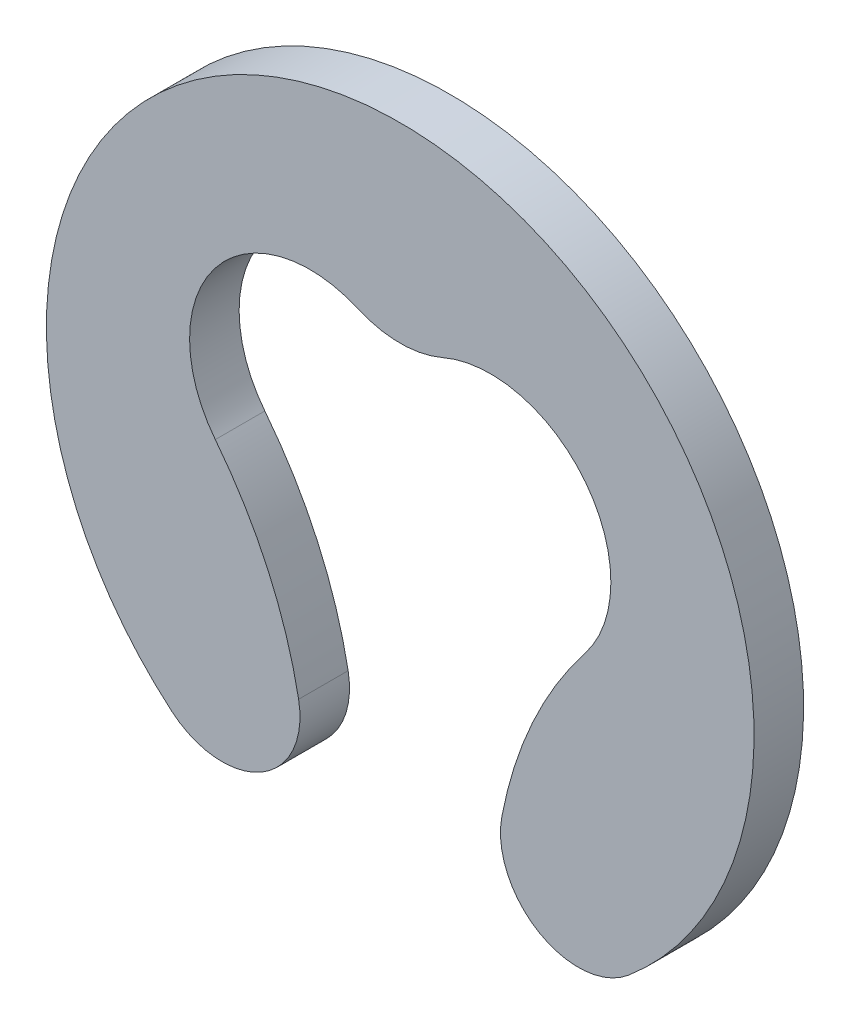
ISO-10303-21;
HEADER;
FILE_DESCRIPTION(('STEP AP214'),'2;1');
FILE_NAME('part.step','',(''),(''),'','','');
FILE_SCHEMA(('AUTOMOTIVE_DESIGN { 1 0 10303 214 1 1 1 1 }'));
ENDSEC;
DATA;
#1=APPLICATION_CONTEXT('core data for automotive mechanical design processes');
#2=APPLICATION_PROTOCOL_DEFINITION('international standard','automotive_design',2000,#1);
#3=PRODUCT_CONTEXT('',#1,'mechanical');
#4=PRODUCT('Part','Part','',(#3));
#5=PRODUCT_RELATED_PRODUCT_CATEGORY('part','',(#4));
#6=PRODUCT_DEFINITION_FORMATION('','',#4);
#7=PRODUCT_DEFINITION_CONTEXT('part definition',#1,'design');
#8=PRODUCT_DEFINITION('design','',#6,#7);
#9=PRODUCT_DEFINITION_SHAPE('','',#8);
#10=(LENGTH_UNIT() NAMED_UNIT(*) SI_UNIT(.MILLI.,.METRE.));
#11=(NAMED_UNIT(*) PLANE_ANGLE_UNIT() SI_UNIT($,.RADIAN.));
#12=(NAMED_UNIT(*) SI_UNIT($,.STERADIAN.) SOLID_ANGLE_UNIT());
#13=UNCERTAINTY_MEASURE_WITH_UNIT(LENGTH_MEASURE(1.E-05),#10,'distance_accuracy_value','');
#14=(GEOMETRIC_REPRESENTATION_CONTEXT(3) GLOBAL_UNCERTAINTY_ASSIGNED_CONTEXT((#13)) GLOBAL_UNIT_ASSIGNED_CONTEXT((#10,
#11,#12)) REPRESENTATION_CONTEXT('',''));
#15=CARTESIAN_POINT('',(0.,0.,0.));
#16=DIRECTION('',(0.,0.,1.));
#17=DIRECTION('',(1.,0.,0.));
#18=AXIS2_PLACEMENT_3D('',#15,#16,#17);
#19=CARTESIAN_POINT('',(0.,0.,0.7));
#20=DIRECTION('',(0.,0.,1.));
#21=DIRECTION('',(1.,0.,0.));
#22=AXIS2_PLACEMENT_3D('',#19,#20,#21);
#23=PLANE('',#22);
#24=CARTESIAN_POINT('',(7.33090114238568,-3.89202883347084,0.7));
#25=DIRECTION('',(0.,0.,-1.));
#26=DIRECTION('',(1.,0.,0.));
#27=AXIS2_PLACEMENT_3D('',#24,#25,#26);
#28=CIRCLE('',#27,6.);
#29=CARTESIAN_POINT('',(1.43590173451363,-2.77445020930684,0.7));
#30=VERTEX_POINT('',#29);
#31=CARTESIAN_POINT('',(2.61328937992658,-0.18471993634512,0.7));
#32=VERTEX_POINT('',#31);
#33=EDGE_CURVE('E149',#30,#32,#28,.T.);
#34=ORIENTED_EDGE('',*,*,#33,.F.);
#35=CARTESIAN_POINT('',(2.51665162595684,-2.97933962373691,0.7));
#36=DIRECTION('',(0.,0.,1.));
#37=DIRECTION('',(1.,0.,0.));
#38=AXIS2_PLACEMENT_3D('',#35,#36,#37);
#39=CIRCLE('',#38,1.1);
#40=CARTESIAN_POINT('',(3.22647644353441,-3.81966618427809,0.7));
#41=VERTEX_POINT('',#40);
#42=EDGE_CURVE('E179',#30,#41,#39,.T.);
#43=ORIENTED_EDGE('',*,*,#42,.T.);
#44=CARTESIAN_POINT('',(0.,0.,0.7));
#45=DIRECTION('',(0.,0.,1.));
#46=DIRECTION('',(1.,0.,0.));
#47=AXIS2_PLACEMENT_3D('',#44,#45,#46);
#48=CIRCLE('',#47,5.);
#49=CARTESIAN_POINT('',(-3.22647644353441,-3.81966618427809,0.7));
#50=VERTEX_POINT('',#49);
#51=EDGE_CURVE('E167',#41,#50,#48,.T.);
#52=ORIENTED_EDGE('',*,*,#51,.T.);
#53=CARTESIAN_POINT('',(-2.51665162595684,-2.97933962373691,0.7));
#54=DIRECTION('',(0.,0.,1.));
#55=DIRECTION('',(1.,0.,0.));
#56=AXIS2_PLACEMENT_3D('',#53,#54,#55);
#57=CIRCLE('',#56,1.1);
#58=CARTESIAN_POINT('',(-1.43590173451363,-2.77445020930684,0.7));
#59=VERTEX_POINT('',#58);
#60=EDGE_CURVE('E176',#50,#59,#57,.T.);
#61=ORIENTED_EDGE('',*,*,#60,.T.);
#62=CARTESIAN_POINT('',(-7.33090114238567,-3.89202883347085,0.7));
#63=DIRECTION('',(0.,0.,-1.));
#64=DIRECTION('',(-1.,0.,0.));
#65=AXIS2_PLACEMENT_3D('',#62,#63,#64);
#66=CIRCLE('',#65,6.);
#67=CARTESIAN_POINT('',(-2.61328937992658,-0.18471993634512,0.7));
#68=VERTEX_POINT('',#67);
#69=EDGE_CURVE('E146',#68,#59,#66,.T.);
#70=ORIENTED_EDGE('',*,*,#69,.F.);
#71=CARTESIAN_POINT('',(-1.2766327138965,0.865684251173833,0.7));
#72=DIRECTION('',(0.,0.,1.));
#73=DIRECTION('',(1.,0.,0.));
#74=AXIS2_PLACEMENT_3D('',#71,#72,#73);
#75=CIRCLE('',#74,1.7);
#76=CARTESIAN_POINT('',(-0.598421584638982,2.42453949273773,0.7));
#77=VERTEX_POINT('',#76);
#78=EDGE_CURVE('E120',#77,#68,#75,.T.);
#79=ORIENTED_EDGE('',*,*,#78,.F.);
#80=CARTESIAN_POINT('',(0.,3.8,0.7));
#81=DIRECTION('',(0.,0.,-1.));
#82=DIRECTION('',(1.,0.,0.));
#83=AXIS2_PLACEMENT_3D('',#80,#81,#82);
#84=CIRCLE('',#83,1.5);
#85=CARTESIAN_POINT('',(0.598421584638982,2.42453949273773,0.7));
#86=VERTEX_POINT('',#85);
#87=EDGE_CURVE('E124',#86,#77,#84,.T.);
#88=ORIENTED_EDGE('',*,*,#87,.F.);
#89=CARTESIAN_POINT('',(1.2766327138965,0.865684251173834,0.7));
#90=DIRECTION('',(0.,0.,1.));
#91=DIRECTION('',(-1.,0.,0.));
#92=AXIS2_PLACEMENT_3D('',#89,#90,#91);
#93=CIRCLE('',#92,1.7);
#94=EDGE_CURVE('E152',#32,#86,#93,.T.);
#95=ORIENTED_EDGE('',*,*,#94,.F.);
#96=EDGE_LOOP('',(#34,#43,#52,#61,#70,#79,#88,#95));
#97=FACE_BOUND('',#96,.T.);
#98=ADVANCED_FACE('F41',(#97),#23,.T.);
#99=CARTESIAN_POINT('',(0.,0.,0.));
#100=DIRECTION('',(0.,0.,1.));
#101=DIRECTION('',(1.,0.,0.));
#102=AXIS2_PLACEMENT_3D('',#99,#100,#101);
#103=PLANE('',#102);
#104=CARTESIAN_POINT('',(0.,0.,0.));
#105=DIRECTION('',(0.,0.,1.));
#106=DIRECTION('',(1.,0.,0.));
#107=AXIS2_PLACEMENT_3D('',#104,#105,#106);
#108=CIRCLE('',#107,5.);
#109=CARTESIAN_POINT('',(3.22647644353441,-3.81966618427809,0.));
#110=VERTEX_POINT('',#109);
#111=CARTESIAN_POINT('',(-3.22647644353441,-3.81966618427809,0.));
#112=VERTEX_POINT('',#111);
#113=EDGE_CURVE('E111',#110,#112,#108,.T.);
#114=ORIENTED_EDGE('',*,*,#113,.F.);
#115=CARTESIAN_POINT('',(2.51665162595684,-2.97933962373691,0.));
#116=DIRECTION('',(0.,0.,1.));
#117=DIRECTION('',(1.,0.,0.));
#118=AXIS2_PLACEMENT_3D('',#115,#116,#117);
#119=CIRCLE('',#118,1.1);
#120=CARTESIAN_POINT('',(1.43590173451363,-2.77445020930684,0.));
#121=VERTEX_POINT('',#120);
#122=EDGE_CURVE('E50',#110,#121,#119,.F.);
#123=ORIENTED_EDGE('',*,*,#122,.T.);
#124=CARTESIAN_POINT('',(7.33090114238568,-3.89202883347084,0.));
#125=DIRECTION('',(0.,0.,1.));
#126=DIRECTION('',(1.,0.,0.));
#127=AXIS2_PLACEMENT_3D('',#124,#125,#126);
#128=CIRCLE('',#127,6.);
#129=CARTESIAN_POINT('',(2.61328937992658,-0.18471993634512,0.));
#130=VERTEX_POINT('',#129);
#131=EDGE_CURVE('E140',#130,#121,#128,.T.);
#132=ORIENTED_EDGE('',*,*,#131,.F.);
#133=CARTESIAN_POINT('',(1.2766327138965,0.865684251173834,0.));
#134=DIRECTION('',(0.,0.,1.));
#135=DIRECTION('',(1.,0.,0.));
#136=AXIS2_PLACEMENT_3D('',#133,#134,#135);
#137=CIRCLE('',#136,1.7);
#138=CARTESIAN_POINT('',(0.598421584638982,2.42453949273773,0.));
#139=VERTEX_POINT('',#138);
#140=EDGE_CURVE('E134',#139,#130,#137,.F.);
#141=ORIENTED_EDGE('',*,*,#140,.F.);
#142=CARTESIAN_POINT('',(0.,3.8,0.));
#143=DIRECTION('',(0.,0.,1.));
#144=DIRECTION('',(1.,0.,0.));
#145=AXIS2_PLACEMENT_3D('',#142,#143,#144);
#146=CIRCLE('',#145,1.5);
#147=CARTESIAN_POINT('',(-0.598421584638982,2.42453949273773,0.));
#148=VERTEX_POINT('',#147);
#149=EDGE_CURVE('E129',#148,#139,#146,.T.);
#150=ORIENTED_EDGE('',*,*,#149,.F.);
#151=CARTESIAN_POINT('',(-1.2766327138965,0.865684251173833,0.));
#152=DIRECTION('',(0.,0.,1.));
#153=DIRECTION('',(1.,0.,0.));
#154=AXIS2_PLACEMENT_3D('',#151,#152,#153);
#155=CIRCLE('',#154,1.7);
#156=CARTESIAN_POINT('',(-2.61328937992658,-0.18471993634512,0.));
#157=VERTEX_POINT('',#156);
#158=EDGE_CURVE('E117',#157,#148,#155,.F.);
#159=ORIENTED_EDGE('',*,*,#158,.F.);
#160=CARTESIAN_POINT('',(-7.33090114238567,-3.89202883347085,0.));
#161=DIRECTION('',(0.,0.,1.));
#162=DIRECTION('',(1.,0.,0.));
#163=AXIS2_PLACEMENT_3D('',#160,#161,#162);
#164=CIRCLE('',#163,6.);
#165=CARTESIAN_POINT('',(-1.43590173451363,-2.77445020930684,0.));
#166=VERTEX_POINT('',#165);
#167=EDGE_CURVE('E104',#166,#157,#164,.T.);
#168=ORIENTED_EDGE('',*,*,#167,.F.);
#169=CARTESIAN_POINT('',(-2.51665162595684,-2.97933962373691,0.));
#170=DIRECTION('',(0.,0.,1.));
#171=DIRECTION('',(1.,0.,0.));
#172=AXIS2_PLACEMENT_3D('',#169,#170,#171);
#173=CIRCLE('',#172,1.1);
#174=EDGE_CURVE('E62',#166,#112,#173,.F.);
#175=ORIENTED_EDGE('',*,*,#174,.T.);
#176=EDGE_LOOP('',(#114,#123,#132,#141,#150,#159,#168,#175));
#177=FACE_BOUND('',#176,.T.);
#178=ADVANCED_FACE('F126',(#177),#103,.F.);
#179=CARTESIAN_POINT('',(0.,0.,0.7));
#180=DIRECTION('',(0.,0.,-1.));
#181=DIRECTION('',(-1.,0.,0.));
#182=AXIS2_PLACEMENT_3D('',#179,#180,#181);
#183=CYLINDRICAL_SURFACE('',#182,5.);
#184=ORIENTED_EDGE('',*,*,#51,.F.);
#185=DIRECTION('',(0.,0.,-1.));
#186=VECTOR('',#185,1.);
#187=CARTESIAN_POINT('',(3.22647644353441,-3.81966618427809,0.7));
#188=LINE('',#187,#186);
#189=EDGE_CURVE('E186',#41,#110,#188,.T.);
#190=ORIENTED_EDGE('',*,*,#189,.T.);
#191=ORIENTED_EDGE('',*,*,#113,.T.);
#192=DIRECTION('',(0.,0.,-1.));
#193=VECTOR('',#192,1.);
#194=CARTESIAN_POINT('',(-3.22647644353441,-3.81966618427809,0.7));
#195=LINE('',#194,#193);
#196=EDGE_CURVE('E182',#112,#50,#195,.F.);
#197=ORIENTED_EDGE('',*,*,#196,.T.);
#198=EDGE_LOOP('',(#184,#190,#191,#197));
#199=FACE_BOUND('',#198,.T.);
#200=ADVANCED_FACE('F204',(#199),#183,.T.);
#201=CARTESIAN_POINT('',(-1.2766327138965,0.865684251173833,-0.00100000000000002));
#202=DIRECTION('',(0.,0.,1.));
#203=DIRECTION('',(1.,0.,0.));
#204=AXIS2_PLACEMENT_3D('',#201,#202,#203);
#205=CYLINDRICAL_SURFACE('',#204,1.7);
#206=ORIENTED_EDGE('',*,*,#158,.T.);
#207=DIRECTION('',(0.,0.,1.));
#208=VECTOR('',#207,1.);
#209=CARTESIAN_POINT('',(-0.598421584638982,2.42453949273773,-0.00100000000000002));
#210=LINE('',#209,#208);
#211=EDGE_CURVE('E112',#148,#77,#210,.T.);
#212=ORIENTED_EDGE('',*,*,#211,.T.);
#213=ORIENTED_EDGE('',*,*,#78,.T.);
#214=DIRECTION('',(0.,0.,1.));
#215=VECTOR('',#214,1.);
#216=CARTESIAN_POINT('',(-2.61328937992658,-0.18471993634512,-0.00100000000000002));
#217=LINE('',#216,#215);
#218=EDGE_CURVE('E107',#157,#68,#217,.T.);
#219=ORIENTED_EDGE('',*,*,#218,.F.);
#220=EDGE_LOOP('',(#206,#212,#213,#219));
#221=FACE_BOUND('',#220,.T.);
#222=ADVANCED_FACE('F116',(#221),#205,.F.);
#223=CARTESIAN_POINT('',(0.,3.8,-0.00100000000000002));
#224=DIRECTION('',(0.,0.,1.));
#225=DIRECTION('',(1.,0.,0.));
#226=AXIS2_PLACEMENT_3D('',#223,#224,#225);
#227=CYLINDRICAL_SURFACE('',#226,1.5);
#228=ORIENTED_EDGE('',*,*,#149,.T.);
#229=DIRECTION('',(0.,0.,1.));
#230=VECTOR('',#229,1.);
#231=CARTESIAN_POINT('',(0.598421584638982,2.42453949273773,-0.00100000000000002));
#232=LINE('',#231,#230);
#233=EDGE_CURVE('E161',#139,#86,#232,.T.);
#234=ORIENTED_EDGE('',*,*,#233,.T.);
#235=ORIENTED_EDGE('',*,*,#87,.T.);
#236=ORIENTED_EDGE('',*,*,#211,.F.);
#237=EDGE_LOOP('',(#228,#234,#235,#236));
#238=FACE_BOUND('',#237,.T.);
#239=ADVANCED_FACE('F209',(#238),#227,.T.);
#240=CARTESIAN_POINT('',(1.2766327138965,0.865684251173834,-0.00100000000000002));
#241=DIRECTION('',(0.,0.,1.));
#242=DIRECTION('',(1.,0.,0.));
#243=AXIS2_PLACEMENT_3D('',#240,#241,#242);
#244=CYLINDRICAL_SURFACE('',#243,1.7);
#245=ORIENTED_EDGE('',*,*,#140,.T.);
#246=DIRECTION('',(0.,0.,1.));
#247=VECTOR('',#246,1.);
#248=CARTESIAN_POINT('',(2.61328937992658,-0.18471993634512,-0.00100000000000002));
#249=LINE('',#248,#247);
#250=EDGE_CURVE('E123',#130,#32,#249,.T.);
#251=ORIENTED_EDGE('',*,*,#250,.T.);
#252=ORIENTED_EDGE('',*,*,#94,.T.);
#253=ORIENTED_EDGE('',*,*,#233,.F.);
#254=EDGE_LOOP('',(#245,#251,#252,#253));
#255=FACE_BOUND('',#254,.T.);
#256=ADVANCED_FACE('F211',(#255),#244,.F.);
#257=CARTESIAN_POINT('',(7.33090114238568,-3.89202883347084,-0.00100000000000002));
#258=DIRECTION('',(0.,0.,1.));
#259=DIRECTION('',(1.,0.,0.));
#260=AXIS2_PLACEMENT_3D('',#257,#258,#259);
#261=CYLINDRICAL_SURFACE('',#260,6.);
#262=ORIENTED_EDGE('',*,*,#131,.T.);
#263=DIRECTION('',(0.,0.,1.));
#264=VECTOR('',#263,1.);
#265=CARTESIAN_POINT('',(1.43590173451363,-2.77445020930684,-0.00100000000000002));
#266=LINE('',#265,#264);
#267=EDGE_CURVE('E171',#121,#30,#266,.T.);
#268=ORIENTED_EDGE('',*,*,#267,.T.);
#269=ORIENTED_EDGE('',*,*,#33,.T.);
#270=ORIENTED_EDGE('',*,*,#250,.F.);
#271=EDGE_LOOP('',(#262,#268,#269,#270));
#272=FACE_BOUND('',#271,.T.);
#273=ADVANCED_FACE('F197',(#272),#261,.T.);
#274=CARTESIAN_POINT('',(-7.33090114238567,-3.89202883347085,-0.00100000000000002));
#275=DIRECTION('',(0.,0.,1.));
#276=DIRECTION('',(1.,0.,0.));
#277=AXIS2_PLACEMENT_3D('',#274,#275,#276);
#278=CYLINDRICAL_SURFACE('',#277,6.);
#279=ORIENTED_EDGE('',*,*,#69,.T.);
#280=DIRECTION('',(0.,0.,1.));
#281=VECTOR('',#280,1.);
#282=CARTESIAN_POINT('',(-1.43590173451363,-2.77445020930684,-0.00100000000000002));
#283=LINE('',#282,#281);
#284=EDGE_CURVE('E11',#59,#166,#283,.F.);
#285=ORIENTED_EDGE('',*,*,#284,.T.);
#286=ORIENTED_EDGE('',*,*,#167,.T.);
#287=ORIENTED_EDGE('',*,*,#218,.T.);
#288=EDGE_LOOP('',(#279,#285,#286,#287));
#289=FACE_BOUND('',#288,.T.);
#290=ADVANCED_FACE('F106',(#289),#278,.T.);
#291=CARTESIAN_POINT('',(2.51665162595684,-2.97933962373691,0.7));
#292=DIRECTION('',(0.,0.,1.));
#293=DIRECTION('',(1.,0.,0.));
#294=AXIS2_PLACEMENT_3D('',#291,#292,#293);
#295=CYLINDRICAL_SURFACE('',#294,1.1);
#296=ORIENTED_EDGE('',*,*,#122,.F.);
#297=ORIENTED_EDGE('',*,*,#189,.F.);
#298=ORIENTED_EDGE('',*,*,#42,.F.);
#299=ORIENTED_EDGE('',*,*,#267,.F.);
#300=EDGE_LOOP('',(#296,#297,#298,#299));
#301=FACE_BOUND('',#300,.T.);
#302=ADVANCED_FACE('F199',(#301),#295,.T.);
#303=CARTESIAN_POINT('',(-2.51665162595684,-2.97933962373691,-0.00100000000000002));
#304=DIRECTION('',(0.,0.,1.));
#305=DIRECTION('',(1.,0.,0.));
#306=AXIS2_PLACEMENT_3D('',#303,#304,#305);
#307=CYLINDRICAL_SURFACE('',#306,1.1);
#308=ORIENTED_EDGE('',*,*,#174,.F.);
#309=ORIENTED_EDGE('',*,*,#284,.F.);
#310=ORIENTED_EDGE('',*,*,#60,.F.);
#311=ORIENTED_EDGE('',*,*,#196,.F.);
#312=EDGE_LOOP('',(#308,#309,#310,#311));
#313=FACE_BOUND('',#312,.T.);
#314=ADVANCED_FACE('F43',(#313),#307,.T.);
#315=CLOSED_SHELL('',(#98,#178,#200,#222,#239,#256,#273,#290,#302,#314));
#316=MANIFOLD_SOLID_BREP('B2',#315);
#317=ADVANCED_BREP_SHAPE_REPRESENTATION('',(#18,#316),#14);
#318=SHAPE_DEFINITION_REPRESENTATION(#9,#317);
ENDSEC;
END-ISO-10303-21;
